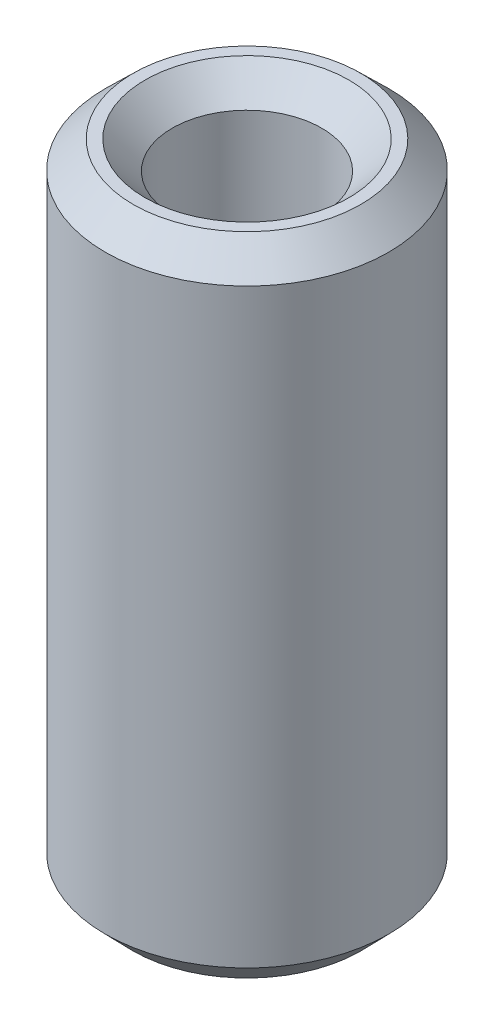
ISO-10303-21;
HEADER;
FILE_DESCRIPTION(('STEP AP214'),'2;1');
FILE_NAME('part.step','',(''),(''),'','','');
FILE_SCHEMA(('AUTOMOTIVE_DESIGN { 1 0 10303 214 1 1 1 1 }'));
ENDSEC;
DATA;
#1=APPLICATION_CONTEXT('core data for automotive mechanical design processes');
#2=APPLICATION_PROTOCOL_DEFINITION('international standard','automotive_design',2000,#1);
#3=PRODUCT_CONTEXT('',#1,'mechanical');
#4=PRODUCT('Part','Part','',(#3));
#5=PRODUCT_RELATED_PRODUCT_CATEGORY('part','',(#4));
#6=PRODUCT_DEFINITION_FORMATION('','',#4);
#7=PRODUCT_DEFINITION_CONTEXT('part definition',#1,'design');
#8=PRODUCT_DEFINITION('design','',#6,#7);
#9=PRODUCT_DEFINITION_SHAPE('','',#8);
#10=(LENGTH_UNIT() NAMED_UNIT(*) SI_UNIT(.MILLI.,.METRE.));
#11=(NAMED_UNIT(*) PLANE_ANGLE_UNIT() SI_UNIT($,.RADIAN.));
#12=(NAMED_UNIT(*) SI_UNIT($,.STERADIAN.) SOLID_ANGLE_UNIT());
#13=UNCERTAINTY_MEASURE_WITH_UNIT(LENGTH_MEASURE(1.E-05),#10,'distance_accuracy_value','');
#14=(GEOMETRIC_REPRESENTATION_CONTEXT(3) GLOBAL_UNCERTAINTY_ASSIGNED_CONTEXT((#13)) GLOBAL_UNIT_ASSIGNED_CONTEXT((#10,
#11,#12)) REPRESENTATION_CONTEXT('',''));
#15=CARTESIAN_POINT('',(0.,0.,0.));
#16=DIRECTION('',(0.,0.,1.));
#17=DIRECTION('',(1.,0.,0.));
#18=AXIS2_PLACEMENT_3D('',#15,#16,#17);
#19=CARTESIAN_POINT('',(0.,56.9574158522943,0.));
#20=DIRECTION('',(0.,-1.,0.));
#21=DIRECTION('',(0.,0.,-1.));
#22=AXIS2_PLACEMENT_3D('',#19,#20,#21);
#23=CYLINDRICAL_SURFACE('',#22,12.5);
#24=CARTESIAN_POINT('',(0.,2.46889268520039,0.));
#25=DIRECTION('',(0.,1.,0.));
#26=DIRECTION('',(0.,0.,1.));
#27=AXIS2_PLACEMENT_3D('',#24,#25,#26);
#28=CIRCLE('',#27,12.5);
#29=CARTESIAN_POINT('',(0.,2.46889268520039,12.5));
#30=VERTEX_POINT('',#29);
#31=EDGE_CURVE('E10',#30,#30,#28,.T.);
#32=ORIENTED_EDGE('',*,*,#31,.T.);
#33=EDGE_LOOP('',(#32));
#34=FACE_BOUND('',#33,.T.);
#35=CARTESIAN_POINT('',(0.,54.5509426698833,0.));
#36=DIRECTION('',(0.,1.,0.));
#37=DIRECTION('',(0.,0.,1.));
#38=AXIS2_PLACEMENT_3D('',#35,#36,#37);
#39=CIRCLE('',#38,12.5);
#40=CARTESIAN_POINT('',(0.,54.5509426698833,12.5));
#41=VERTEX_POINT('',#40);
#42=EDGE_CURVE('E50',#41,#41,#39,.F.);
#43=ORIENTED_EDGE('',*,*,#42,.T.);
#44=EDGE_LOOP('',(#43));
#45=FACE_BOUND('',#44,.T.);
#46=ADVANCED_FACE('F39',(#34,#45),#23,.T.);
#47=CARTESIAN_POINT('',(0.,56.9574158522943,0.));
#48=DIRECTION('',(0.,1.,0.));
#49=DIRECTION('',(0.,0.,1.));
#50=AXIS2_PLACEMENT_3D('',#47,#48,#49);
#51=PLANE('',#50);
#52=CARTESIAN_POINT('',(0.,56.9574158522943,0.));
#53=DIRECTION('',(0.,1.,0.));
#54=DIRECTION('',(0.,0.,1.));
#55=AXIS2_PLACEMENT_3D('',#52,#53,#54);
#56=CIRCLE('',#55,8.99397139020975);
#57=CARTESIAN_POINT('',(0.,56.9574158522943,8.99397139020975));
#58=VERTEX_POINT('',#57);
#59=EDGE_CURVE('E58',#58,#58,#56,.F.);
#60=ORIENTED_EDGE('',*,*,#59,.T.);
#61=EDGE_LOOP('',(#60));
#62=FACE_BOUND('',#61,.T.);
#63=CARTESIAN_POINT('',(0.,56.9574158522943,0.));
#64=DIRECTION('',(0.,1.,0.));
#65=DIRECTION('',(0.,0.,1.));
#66=AXIS2_PLACEMENT_3D('',#63,#64,#65);
#67=CIRCLE('',#66,10.0311073147996);
#68=CARTESIAN_POINT('',(0.,56.9574158522943,10.0311073147996));
#69=VERTEX_POINT('',#68);
#70=EDGE_CURVE('E61',#69,#69,#67,.T.);
#71=ORIENTED_EDGE('',*,*,#70,.T.);
#72=EDGE_LOOP('',(#71));
#73=FACE_BOUND('',#72,.T.);
#74=ADVANCED_FACE('F88',(#62,#73),#51,.T.);
#75=CARTESIAN_POINT('',(0.,0.,0.));
#76=DIRECTION('',(0.,1.,0.));
#77=DIRECTION('',(0.,0.,1.));
#78=AXIS2_PLACEMENT_3D('',#75,#76,#77);
#79=PLANE('',#78);
#80=CARTESIAN_POINT('',(0.,0.,0.));
#81=DIRECTION('',(0.,1.,0.));
#82=DIRECTION('',(0.,0.,1.));
#83=AXIS2_PLACEMENT_3D('',#80,#81,#82);
#84=CIRCLE('',#83,9.05639089299913);
#85=CARTESIAN_POINT('',(0.,0.,9.05639089299913));
#86=VERTEX_POINT('',#85);
#87=EDGE_CURVE('E51',#86,#86,#84,.T.);
#88=ORIENTED_EDGE('',*,*,#87,.T.);
#89=EDGE_LOOP('',(#88));
#90=FACE_BOUND('',#89,.T.);
#91=CARTESIAN_POINT('',(0.,0.,0.));
#92=DIRECTION('',(0.,1.,0.));
#93=DIRECTION('',(0.,0.,1.));
#94=AXIS2_PLACEMENT_3D('',#91,#92,#93);
#95=CIRCLE('',#94,10.093526817589);
#96=CARTESIAN_POINT('',(0.,0.,10.093526817589));
#97=VERTEX_POINT('',#96);
#98=EDGE_CURVE('E54',#97,#97,#95,.F.);
#99=ORIENTED_EDGE('',*,*,#98,.T.);
#100=EDGE_LOOP('',(#99));
#101=FACE_BOUND('',#100,.T.);
#102=ADVANCED_FACE('F83',(#90,#101),#79,.F.);
#103=CARTESIAN_POINT('',(0.,56.9574158522943,0.));
#104=DIRECTION('',(0.,-1.,0.));
#105=DIRECTION('',(0.,0.,-1.));
#106=AXIS2_PLACEMENT_3D('',#103,#104,#105);
#107=CYLINDRICAL_SURFACE('',#106,6.58749820779875);
#108=CARTESIAN_POINT('',(0.,54.4885231670939,0.));
#109=DIRECTION('',(0.,1.,0.));
#110=DIRECTION('',(0.,0.,1.));
#111=AXIS2_PLACEMENT_3D('',#108,#109,#110);
#112=CIRCLE('',#111,6.58749820779875);
#113=CARTESIAN_POINT('',(0.,54.4885231670939,6.58749820779875));
#114=VERTEX_POINT('',#113);
#115=EDGE_CURVE('E67',#114,#114,#112,.T.);
#116=ORIENTED_EDGE('',*,*,#115,.T.);
#117=EDGE_LOOP('',(#116));
#118=FACE_BOUND('',#117,.T.);
#119=CARTESIAN_POINT('',(0.,2.40647318241099,0.));
#120=DIRECTION('',(0.,1.,0.));
#121=DIRECTION('',(0.,0.,1.));
#122=AXIS2_PLACEMENT_3D('',#119,#120,#121);
#123=CIRCLE('',#122,6.58749820779875);
#124=CARTESIAN_POINT('',(0.,2.40647318241099,6.58749820779875));
#125=VERTEX_POINT('',#124);
#126=EDGE_CURVE('E69',#125,#125,#123,.F.);
#127=ORIENTED_EDGE('',*,*,#126,.T.);
#128=EDGE_LOOP('',(#127));
#129=FACE_BOUND('',#128,.T.);
#130=ADVANCED_FACE('F71',(#118,#129),#107,.F.);
#131=CARTESIAN_POINT('',(0.,54.4885231670939,0.));
#132=DIRECTION('',(0.,1.,0.));
#133=DIRECTION('',(0.,0.,1.));
#134=AXIS2_PLACEMENT_3D('',#131,#132,#133);
#135=CONICAL_SURFACE('',#134,6.58749820779875,0.77259582317042);
#136=ORIENTED_EDGE('',*,*,#59,.F.);
#137=EDGE_LOOP('',(#136));
#138=FACE_BOUND('',#137,.T.);
#139=ORIENTED_EDGE('',*,*,#115,.F.);
#140=EDGE_LOOP('',(#139));
#141=FACE_BOUND('',#140,.T.);
#142=ADVANCED_FACE('F77',(#138,#141),#135,.F.);
#143=CARTESIAN_POINT('',(0.,0.,0.));
#144=DIRECTION('',(0.,-1.,0.));
#145=DIRECTION('',(0.,0.,-1.));
#146=AXIS2_PLACEMENT_3D('',#143,#144,#145);
#147=CONICAL_SURFACE('',#146,9.05639089299913,0.798200503624475);
#148=ORIENTED_EDGE('',*,*,#126,.F.);
#149=EDGE_LOOP('',(#148));
#150=FACE_BOUND('',#149,.T.);
#151=ORIENTED_EDGE('',*,*,#87,.F.);
#152=EDGE_LOOP('',(#151));
#153=FACE_BOUND('',#152,.T.);
#154=ADVANCED_FACE('F73',(#150,#153),#147,.F.);
#155=CARTESIAN_POINT('',(0.,2.46889268520039,0.));
#156=DIRECTION('',(0.,1.,0.));
#157=DIRECTION('',(0.,0.,1.));
#158=AXIS2_PLACEMENT_3D('',#155,#156,#157);
#159=CONICAL_SURFACE('',#158,12.5,0.772595823170421);
#160=ORIENTED_EDGE('',*,*,#98,.F.);
#161=EDGE_LOOP('',(#160));
#162=FACE_BOUND('',#161,.T.);
#163=ORIENTED_EDGE('',*,*,#31,.F.);
#164=EDGE_LOOP('',(#163));
#165=FACE_BOUND('',#164,.T.);
#166=ADVANCED_FACE('F76',(#162,#165),#159,.T.);
#167=CARTESIAN_POINT('',(0.,56.9574158522943,0.));
#168=DIRECTION('',(0.,-1.,0.));
#169=DIRECTION('',(0.,0.,-1.));
#170=AXIS2_PLACEMENT_3D('',#167,#168,#169);
#171=CONICAL_SURFACE('',#170,10.0311073147996,0.798200503624476);
#172=ORIENTED_EDGE('',*,*,#42,.F.);
#173=EDGE_LOOP('',(#172));
#174=FACE_BOUND('',#173,.T.);
#175=ORIENTED_EDGE('',*,*,#70,.F.);
#176=EDGE_LOOP('',(#175));
#177=FACE_BOUND('',#176,.T.);
#178=ADVANCED_FACE('F45',(#174,#177),#171,.T.);
#179=CLOSED_SHELL('',(#46,#74,#102,#130,#142,#154,#166,#178));
#180=MANIFOLD_SOLID_BREP('B2',#179);
#181=ADVANCED_BREP_SHAPE_REPRESENTATION('',(#18,#180),#14);
#182=SHAPE_DEFINITION_REPRESENTATION(#9,#181);
ENDSEC;
END-ISO-10303-21;
